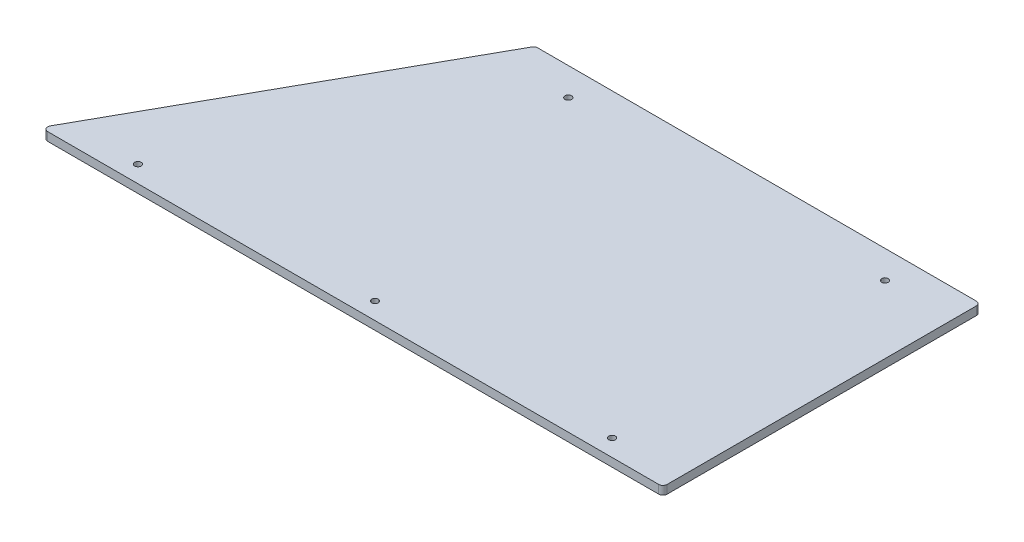
ISO-10303-21;
HEADER;
FILE_DESCRIPTION(('STEP AP214'),'2;1');
FILE_NAME('part.step','',(''),(''),'','','');
FILE_SCHEMA(('AUTOMOTIVE_DESIGN { 1 0 10303 214 1 1 1 1 }'));
ENDSEC;
DATA;
#1=APPLICATION_CONTEXT('core data for automotive mechanical design processes');
#2=APPLICATION_PROTOCOL_DEFINITION('international standard','automotive_design',2000,#1);
#3=PRODUCT_CONTEXT('',#1,'mechanical');
#4=PRODUCT('Part','Part','',(#3));
#5=PRODUCT_RELATED_PRODUCT_CATEGORY('part','',(#4));
#6=PRODUCT_DEFINITION_FORMATION('','',#4);
#7=PRODUCT_DEFINITION_CONTEXT('part definition',#1,'design');
#8=PRODUCT_DEFINITION('design','',#6,#7);
#9=PRODUCT_DEFINITION_SHAPE('','',#8);
#10=(LENGTH_UNIT() NAMED_UNIT(*) SI_UNIT(.MILLI.,.METRE.));
#11=(NAMED_UNIT(*) PLANE_ANGLE_UNIT() SI_UNIT($,.RADIAN.));
#12=(NAMED_UNIT(*) SI_UNIT($,.STERADIAN.) SOLID_ANGLE_UNIT());
#13=UNCERTAINTY_MEASURE_WITH_UNIT(LENGTH_MEASURE(1.E-05),#10,'distance_accuracy_value','');
#14=(GEOMETRIC_REPRESENTATION_CONTEXT(3) GLOBAL_UNCERTAINTY_ASSIGNED_CONTEXT((#13)) GLOBAL_UNIT_ASSIGNED_CONTEXT((#10,
#11,#12)) REPRESENTATION_CONTEXT('',''));
#15=CARTESIAN_POINT('',(0.,0.,0.));
#16=DIRECTION('',(0.,0.,1.));
#17=DIRECTION('',(1.,0.,0.));
#18=AXIS2_PLACEMENT_3D('',#15,#16,#17);
#19=CARTESIAN_POINT('',(0.,6.35,0.));
#20=DIRECTION('',(0.,1.,0.));
#21=DIRECTION('',(0.,0.,1.));
#22=AXIS2_PLACEMENT_3D('',#19,#20,#21);
#23=PLANE('',#22);
#24=CARTESIAN_POINT('',(60.325,6.35,-12.7));
#25=DIRECTION('',(0.,1.,0.));
#26=DIRECTION('',(0.,0.,1.));
#27=AXIS2_PLACEMENT_3D('',#24,#25,#26);
#28=CIRCLE('',#27,2.45745);
#29=CARTESIAN_POINT('',(60.325,6.35,-10.24255));
#30=VERTEX_POINT('',#29);
#31=EDGE_CURVE('E196',#30,#30,#28,.T.);
#32=ORIENTED_EDGE('',*,*,#31,.F.);
#33=EDGE_LOOP('',(#32));
#34=FACE_BOUND('',#33,.T.);
#35=CARTESIAN_POINT('',(415.925,6.35,-12.7));
#36=DIRECTION('',(0.,1.,0.));
#37=DIRECTION('',(0.,0.,1.));
#38=AXIS2_PLACEMENT_3D('',#35,#36,#37);
#39=CIRCLE('',#38,2.45744999999996);
#40=CARTESIAN_POINT('',(415.925,6.35,-10.24255));
#41=VERTEX_POINT('',#40);
#42=EDGE_CURVE('E185',#41,#41,#39,.T.);
#43=ORIENTED_EDGE('',*,*,#42,.F.);
#44=EDGE_LOOP('',(#43));
#45=FACE_BOUND('',#44,.T.);
#46=DIRECTION('',(-0.487097705254162,0.,0.873347482698685));
#47=VECTOR('',#46,1.);
#48=CARTESIAN_POINT('',(0.,6.35,0.));
#49=LINE('',#48,#47);
#50=CARTESIAN_POINT('',(131.902732744387,6.35,-236.496535214182));
#51=VERTEX_POINT('',#50);
#52=CARTESIAN_POINT('',(2.63337218422856,6.35,-4.72153521418196));
#53=VERTEX_POINT('',#52);
#54=EDGE_CURVE('E140',#51,#53,#49,.T.);
#55=ORIENTED_EDGE('',*,*,#54,.T.);
#56=CARTESIAN_POINT('',(5.40625044179688,6.35,-3.175));
#57=DIRECTION('',(0.,1.,0.));
#58=DIRECTION('',(0.,0.,1.));
#59=AXIS2_PLACEMENT_3D('',#56,#57,#58);
#60=CIRCLE('',#59,3.175);
#61=CARTESIAN_POINT('',(5.40625044179688,6.35,0.));
#62=VERTEX_POINT('',#61);
#63=EDGE_CURVE('E159',#53,#62,#60,.T.);
#64=ORIENTED_EDGE('',*,*,#63,.T.);
#65=DIRECTION('',(1.,0.,0.));
#66=VECTOR('',#65,1.);
#67=CARTESIAN_POINT('',(466.725,6.35,0.));
#68=LINE('',#67,#66);
#69=CARTESIAN_POINT('',(463.55,6.35,0.));
#70=VERTEX_POINT('',#69);
#71=EDGE_CURVE('E123',#62,#70,#68,.T.);
#72=ORIENTED_EDGE('',*,*,#71,.T.);
#73=CARTESIAN_POINT('',(463.55,6.35,-3.17500000000001));
#74=DIRECTION('',(0.,1.,0.));
#75=DIRECTION('',(0.,0.,1.));
#76=AXIS2_PLACEMENT_3D('',#73,#74,#75);
#77=CIRCLE('',#76,3.175);
#78=CARTESIAN_POINT('',(466.725,6.35,-3.17500000000001));
#79=VERTEX_POINT('',#78);
#80=EDGE_CURVE('E154',#70,#79,#77,.T.);
#81=ORIENTED_EDGE('',*,*,#80,.T.);
#82=DIRECTION('',(0.,0.,-1.));
#83=VECTOR('',#82,1.);
#84=CARTESIAN_POINT('',(466.725,6.35,-238.125));
#85=LINE('',#84,#83);
#86=CARTESIAN_POINT('',(466.725,6.35,-234.95));
#87=VERTEX_POINT('',#86);
#88=EDGE_CURVE('E170',#79,#87,#85,.T.);
#89=ORIENTED_EDGE('',*,*,#88,.T.);
#90=CARTESIAN_POINT('',(463.55,6.35,-234.95));
#91=DIRECTION('',(0.,1.,0.));
#92=DIRECTION('',(0.,0.,1.));
#93=AXIS2_PLACEMENT_3D('',#90,#91,#92);
#94=CIRCLE('',#93,3.175);
#95=CARTESIAN_POINT('',(463.55,6.35,-238.125));
#96=VERTEX_POINT('',#95);
#97=EDGE_CURVE('E59',#87,#96,#94,.T.);
#98=ORIENTED_EDGE('',*,*,#97,.T.);
#99=DIRECTION('',(-1.,0.,0.));
#100=VECTOR('',#99,1.);
#101=CARTESIAN_POINT('',(132.810986876875,6.35,-238.125));
#102=LINE('',#101,#100);
#103=CARTESIAN_POINT('',(134.675611001956,6.35,-238.125));
#104=VERTEX_POINT('',#103);
#105=EDGE_CURVE('E178',#96,#104,#102,.T.);
#106=ORIENTED_EDGE('',*,*,#105,.T.);
#107=CARTESIAN_POINT('',(134.675611001956,6.35,-234.95));
#108=DIRECTION('',(0.,1.,0.));
#109=DIRECTION('',(0.,0.,1.));
#110=AXIS2_PLACEMENT_3D('',#107,#108,#109);
#111=CIRCLE('',#110,3.175);
#112=EDGE_CURVE('E157',#104,#51,#111,.T.);
#113=ORIENTED_EDGE('',*,*,#112,.T.);
#114=EDGE_LOOP('',(#55,#64,#72,#81,#89,#98,#106,#113));
#115=FACE_BOUND('',#114,.T.);
#116=CARTESIAN_POINT('',(415.925,6.35,-217.297));
#117=DIRECTION('',(0.,1.,0.));
#118=DIRECTION('',(0.,0.,1.));
#119=AXIS2_PLACEMENT_3D('',#116,#117,#118);
#120=CIRCLE('',#119,2.45744999999996);
#121=CARTESIAN_POINT('',(415.925,6.35,-214.83955));
#122=VERTEX_POINT('',#121);
#123=EDGE_CURVE('E131',#122,#122,#120,.T.);
#124=ORIENTED_EDGE('',*,*,#123,.F.);
#125=EDGE_LOOP('',(#124));
#126=FACE_BOUND('',#125,.T.);
#127=CARTESIAN_POINT('',(238.125,6.35,-12.7));
#128=DIRECTION('',(0.,1.,0.));
#129=DIRECTION('',(0.,0.,1.));
#130=AXIS2_PLACEMENT_3D('',#127,#128,#129);
#131=CIRCLE('',#130,2.45745000000002);
#132=CARTESIAN_POINT('',(238.125,6.35,-10.24255));
#133=VERTEX_POINT('',#132);
#134=EDGE_CURVE('E190',#133,#133,#131,.T.);
#135=ORIENTED_EDGE('',*,*,#134,.F.);
#136=EDGE_LOOP('',(#135));
#137=FACE_BOUND('',#136,.T.);
#138=CARTESIAN_POINT('',(178.449400022,6.35,-217.297));
#139=DIRECTION('',(0.,1.,0.));
#140=DIRECTION('',(0.,0.,1.));
#141=AXIS2_PLACEMENT_3D('',#138,#139,#140);
#142=CIRCLE('',#141,2.45744999999992);
#143=CARTESIAN_POINT('',(178.449400022,6.35,-214.83955));
#144=VERTEX_POINT('',#143);
#145=EDGE_CURVE('E202',#144,#144,#142,.T.);
#146=ORIENTED_EDGE('',*,*,#145,.F.);
#147=EDGE_LOOP('',(#146));
#148=FACE_BOUND('',#147,.T.);
#149=ADVANCED_FACE('F37',(#34,#45,#115,#126,#137,#148),#23,.T.);
#150=CARTESIAN_POINT('',(0.,0.,0.));
#151=DIRECTION('',(0.,1.,0.));
#152=DIRECTION('',(0.,0.,1.));
#153=AXIS2_PLACEMENT_3D('',#150,#151,#152);
#154=PLANE('',#153);
#155=DIRECTION('',(1.,0.,0.));
#156=VECTOR('',#155,1.);
#157=CARTESIAN_POINT('',(466.725,0.,0.));
#158=LINE('',#157,#156);
#159=CARTESIAN_POINT('',(5.40625044179688,0.,0.));
#160=VERTEX_POINT('',#159);
#161=CARTESIAN_POINT('',(463.55,0.,0.));
#162=VERTEX_POINT('',#161);
#163=EDGE_CURVE('E120',#160,#162,#158,.T.);
#164=ORIENTED_EDGE('',*,*,#163,.F.);
#165=CARTESIAN_POINT('',(5.40625044179688,0.,-3.175));
#166=DIRECTION('',(0.,1.,0.));
#167=DIRECTION('',(0.,0.,1.));
#168=AXIS2_PLACEMENT_3D('',#165,#166,#167);
#169=CIRCLE('',#168,3.175);
#170=CARTESIAN_POINT('',(2.63337218422856,0.,-4.72153521418196));
#171=VERTEX_POINT('',#170);
#172=EDGE_CURVE('E103',#160,#171,#169,.F.);
#173=ORIENTED_EDGE('',*,*,#172,.T.);
#174=DIRECTION('',(-0.487097705254162,0.,0.873347482698685));
#175=VECTOR('',#174,1.);
#176=CARTESIAN_POINT('',(0.,0.,0.));
#177=LINE('',#176,#175);
#178=CARTESIAN_POINT('',(131.902732744387,0.,-236.496535214182));
#179=VERTEX_POINT('',#178);
#180=EDGE_CURVE('E144',#179,#171,#177,.T.);
#181=ORIENTED_EDGE('',*,*,#180,.F.);
#182=CARTESIAN_POINT('',(134.675611001956,0.,-234.95));
#183=DIRECTION('',(0.,1.,0.));
#184=DIRECTION('',(0.,0.,1.));
#185=AXIS2_PLACEMENT_3D('',#182,#183,#184);
#186=CIRCLE('',#185,3.175);
#187=CARTESIAN_POINT('',(134.675611001956,0.,-238.125));
#188=VERTEX_POINT('',#187);
#189=EDGE_CURVE('E114',#179,#188,#186,.F.);
#190=ORIENTED_EDGE('',*,*,#189,.T.);
#191=DIRECTION('',(-1.,0.,0.));
#192=VECTOR('',#191,1.);
#193=CARTESIAN_POINT('',(132.810986876875,0.,-238.125));
#194=LINE('',#193,#192);
#195=CARTESIAN_POINT('',(463.55,0.,-238.125));
#196=VERTEX_POINT('',#195);
#197=EDGE_CURVE('E134',#196,#188,#194,.T.);
#198=ORIENTED_EDGE('',*,*,#197,.F.);
#199=CARTESIAN_POINT('',(463.55,0.,-234.95));
#200=DIRECTION('',(0.,1.,0.));
#201=DIRECTION('',(0.,0.,1.));
#202=AXIS2_PLACEMENT_3D('',#199,#200,#201);
#203=CIRCLE('',#202,3.175);
#204=CARTESIAN_POINT('',(466.725,0.,-234.95));
#205=VERTEX_POINT('',#204);
#206=EDGE_CURVE('E148',#196,#205,#203,.F.);
#207=ORIENTED_EDGE('',*,*,#206,.T.);
#208=DIRECTION('',(0.,0.,-1.));
#209=VECTOR('',#208,1.);
#210=CARTESIAN_POINT('',(466.725,0.,-238.125));
#211=LINE('',#210,#209);
#212=CARTESIAN_POINT('',(466.725,0.,-3.17500000000001));
#213=VERTEX_POINT('',#212);
#214=EDGE_CURVE('E130',#213,#205,#211,.T.);
#215=ORIENTED_EDGE('',*,*,#214,.F.);
#216=CARTESIAN_POINT('',(463.55,0.,-3.17500000000001));
#217=DIRECTION('',(0.,1.,0.));
#218=DIRECTION('',(0.,0.,1.));
#219=AXIS2_PLACEMENT_3D('',#216,#217,#218);
#220=CIRCLE('',#219,3.175);
#221=EDGE_CURVE('E124',#213,#162,#220,.F.);
#222=ORIENTED_EDGE('',*,*,#221,.T.);
#223=EDGE_LOOP('',(#164,#173,#181,#190,#198,#207,#215,#222));
#224=FACE_BOUND('',#223,.T.);
#225=CARTESIAN_POINT('',(415.925,0.,-217.297));
#226=DIRECTION('',(0.,1.,0.));
#227=DIRECTION('',(0.,0.,1.));
#228=AXIS2_PLACEMENT_3D('',#225,#226,#227);
#229=CIRCLE('',#228,2.45744999999996);
#230=CARTESIAN_POINT('',(415.925,0.,-214.83955));
#231=VERTEX_POINT('',#230);
#232=EDGE_CURVE('E137',#231,#231,#229,.T.);
#233=ORIENTED_EDGE('',*,*,#232,.T.);
#234=EDGE_LOOP('',(#233));
#235=FACE_BOUND('',#234,.T.);
#236=CARTESIAN_POINT('',(415.925,0.,-12.7));
#237=DIRECTION('',(0.,1.,0.));
#238=DIRECTION('',(0.,0.,1.));
#239=AXIS2_PLACEMENT_3D('',#236,#237,#238);
#240=CIRCLE('',#239,2.45744999999996);
#241=CARTESIAN_POINT('',(415.925,0.,-10.24255));
#242=VERTEX_POINT('',#241);
#243=EDGE_CURVE('E187',#242,#242,#240,.T.);
#244=ORIENTED_EDGE('',*,*,#243,.T.);
#245=EDGE_LOOP('',(#244));
#246=FACE_BOUND('',#245,.T.);
#247=CARTESIAN_POINT('',(238.125,0.,-12.7));
#248=DIRECTION('',(0.,1.,0.));
#249=DIRECTION('',(0.,0.,1.));
#250=AXIS2_PLACEMENT_3D('',#247,#248,#249);
#251=CIRCLE('',#250,2.45745000000002);
#252=CARTESIAN_POINT('',(238.125,0.,-10.24255));
#253=VERTEX_POINT('',#252);
#254=EDGE_CURVE('E193',#253,#253,#251,.T.);
#255=ORIENTED_EDGE('',*,*,#254,.T.);
#256=EDGE_LOOP('',(#255));
#257=FACE_BOUND('',#256,.T.);
#258=CARTESIAN_POINT('',(60.325,0.,-12.7));
#259=DIRECTION('',(0.,1.,0.));
#260=DIRECTION('',(0.,0.,1.));
#261=AXIS2_PLACEMENT_3D('',#258,#259,#260);
#262=CIRCLE('',#261,2.45745);
#263=CARTESIAN_POINT('',(60.325,0.,-10.24255));
#264=VERTEX_POINT('',#263);
#265=EDGE_CURVE('E199',#264,#264,#262,.T.);
#266=ORIENTED_EDGE('',*,*,#265,.T.);
#267=EDGE_LOOP('',(#266));
#268=FACE_BOUND('',#267,.T.);
#269=CARTESIAN_POINT('',(178.449400022,0.,-217.297));
#270=DIRECTION('',(0.,1.,0.));
#271=DIRECTION('',(0.,0.,1.));
#272=AXIS2_PLACEMENT_3D('',#269,#270,#271);
#273=CIRCLE('',#272,2.45744999999992);
#274=CARTESIAN_POINT('',(178.449400022,0.,-214.83955));
#275=VERTEX_POINT('',#274);
#276=EDGE_CURVE('E205',#275,#275,#273,.T.);
#277=ORIENTED_EDGE('',*,*,#276,.T.);
#278=EDGE_LOOP('',(#277));
#279=FACE_BOUND('',#278,.T.);
#280=ADVANCED_FACE('F127',(#224,#235,#246,#257,#268,#279),#154,.F.);
#281=CARTESIAN_POINT('',(466.725,6.35,0.));
#282=DIRECTION('',(0.,0.,-1.));
#283=DIRECTION('',(-1.,0.,0.));
#284=AXIS2_PLACEMENT_3D('',#281,#282,#283);
#285=PLANE('',#284);
#286=ORIENTED_EDGE('',*,*,#71,.F.);
#287=DIRECTION('',(0.,-1.,0.));
#288=VECTOR('',#287,1.);
#289=CARTESIAN_POINT('',(5.40625044179688,6.35,0.));
#290=LINE('',#289,#288);
#291=EDGE_CURVE('E107',#62,#160,#290,.T.);
#292=ORIENTED_EDGE('',*,*,#291,.T.);
#293=ORIENTED_EDGE('',*,*,#163,.T.);
#294=DIRECTION('',(0.,-1.,0.));
#295=VECTOR('',#294,1.);
#296=CARTESIAN_POINT('',(463.55,6.35,0.));
#297=LINE('',#296,#295);
#298=EDGE_CURVE('E125',#162,#70,#297,.F.);
#299=ORIENTED_EDGE('',*,*,#298,.T.);
#300=EDGE_LOOP('',(#286,#292,#293,#299));
#301=FACE_BOUND('',#300,.T.);
#302=ADVANCED_FACE('F119',(#301),#285,.F.);
#303=CARTESIAN_POINT('',(466.725,6.35,-238.125));
#304=DIRECTION('',(-1.,0.,0.));
#305=DIRECTION('',(0.,0.,1.));
#306=AXIS2_PLACEMENT_3D('',#303,#304,#305);
#307=PLANE('',#306);
#308=ORIENTED_EDGE('',*,*,#214,.T.);
#309=DIRECTION('',(0.,-1.,0.));
#310=VECTOR('',#309,1.);
#311=CARTESIAN_POINT('',(466.725,6.35,-234.95));
#312=LINE('',#311,#310);
#313=EDGE_CURVE('E11',#205,#87,#312,.F.);
#314=ORIENTED_EDGE('',*,*,#313,.T.);
#315=ORIENTED_EDGE('',*,*,#88,.F.);
#316=DIRECTION('',(0.,-1.,0.));
#317=VECTOR('',#316,1.);
#318=CARTESIAN_POINT('',(466.725,6.35,-3.17500000000001));
#319=LINE('',#318,#317);
#320=EDGE_CURVE('E45',#79,#213,#319,.T.);
#321=ORIENTED_EDGE('',*,*,#320,.T.);
#322=EDGE_LOOP('',(#308,#314,#315,#321));
#323=FACE_BOUND('',#322,.T.);
#324=ADVANCED_FACE('F168',(#323),#307,.F.);
#325=CARTESIAN_POINT('',(132.810986876875,6.35,-238.125));
#326=DIRECTION('',(0.,0.,1.));
#327=DIRECTION('',(1.,0.,0.));
#328=AXIS2_PLACEMENT_3D('',#325,#326,#327);
#329=PLANE('',#328);
#330=ORIENTED_EDGE('',*,*,#197,.T.);
#331=DIRECTION('',(0.,-1.,0.));
#332=VECTOR('',#331,1.);
#333=CARTESIAN_POINT('',(134.675611001956,6.35,-238.125));
#334=LINE('',#333,#332);
#335=EDGE_CURVE('E52',#188,#104,#334,.F.);
#336=ORIENTED_EDGE('',*,*,#335,.T.);
#337=ORIENTED_EDGE('',*,*,#105,.F.);
#338=DIRECTION('',(0.,-1.,0.));
#339=VECTOR('',#338,1.);
#340=CARTESIAN_POINT('',(463.55,6.35,-238.125));
#341=LINE('',#340,#339);
#342=EDGE_CURVE('E161',#96,#196,#341,.T.);
#343=ORIENTED_EDGE('',*,*,#342,.T.);
#344=EDGE_LOOP('',(#330,#336,#337,#343));
#345=FACE_BOUND('',#344,.T.);
#346=ADVANCED_FACE('F177',(#345),#329,.F.);
#347=CARTESIAN_POINT('',(0.,6.35,0.));
#348=DIRECTION('',(0.873347482698685,0.,0.487097705254161));
#349=DIRECTION('',(0.487097705254162,0.,-0.873347482698685));
#350=AXIS2_PLACEMENT_3D('',#347,#348,#349);
#351=PLANE('',#350);
#352=ORIENTED_EDGE('',*,*,#180,.T.);
#353=DIRECTION('',(0.,-1.,0.));
#354=VECTOR('',#353,1.);
#355=CARTESIAN_POINT('',(2.63337218422856,6.35,-4.72153521418196));
#356=LINE('',#355,#354);
#357=EDGE_CURVE('E108',#171,#53,#356,.F.);
#358=ORIENTED_EDGE('',*,*,#357,.T.);
#359=ORIENTED_EDGE('',*,*,#54,.F.);
#360=DIRECTION('',(0.,-1.,0.));
#361=VECTOR('',#360,1.);
#362=CARTESIAN_POINT('',(131.902732744387,6.35,-236.496535214182));
#363=LINE('',#362,#361);
#364=EDGE_CURVE('E113',#51,#179,#363,.T.);
#365=ORIENTED_EDGE('',*,*,#364,.T.);
#366=EDGE_LOOP('',(#352,#358,#359,#365));
#367=FACE_BOUND('',#366,.T.);
#368=ADVANCED_FACE('F228',(#367),#351,.F.);
#369=CARTESIAN_POINT('',(415.925,6.35,-217.297));
#370=DIRECTION('',(0.,-1.,0.));
#371=DIRECTION('',(0.,0.,-1.));
#372=AXIS2_PLACEMENT_3D('',#369,#370,#371);
#373=CYLINDRICAL_SURFACE('',#372,2.45744999999996);
#374=ORIENTED_EDGE('',*,*,#123,.T.);
#375=EDGE_LOOP('',(#374));
#376=FACE_BOUND('',#375,.T.);
#377=ORIENTED_EDGE('',*,*,#232,.F.);
#378=EDGE_LOOP('',(#377));
#379=FACE_BOUND('',#378,.T.);
#380=ADVANCED_FACE('F225',(#376,#379),#373,.F.);
#381=CARTESIAN_POINT('',(415.925,6.35,-12.7));
#382=DIRECTION('',(0.,-1.,0.));
#383=DIRECTION('',(0.,0.,-1.));
#384=AXIS2_PLACEMENT_3D('',#381,#382,#383);
#385=CYLINDRICAL_SURFACE('',#384,2.45744999999996);
#386=ORIENTED_EDGE('',*,*,#42,.T.);
#387=EDGE_LOOP('',(#386));
#388=FACE_BOUND('',#387,.T.);
#389=ORIENTED_EDGE('',*,*,#243,.F.);
#390=EDGE_LOOP('',(#389));
#391=FACE_BOUND('',#390,.T.);
#392=ADVANCED_FACE('F260',(#388,#391),#385,.F.);
#393=CARTESIAN_POINT('',(238.125,6.35,-12.7));
#394=DIRECTION('',(0.,-1.,0.));
#395=DIRECTION('',(0.,0.,-1.));
#396=AXIS2_PLACEMENT_3D('',#393,#394,#395);
#397=CYLINDRICAL_SURFACE('',#396,2.45745000000002);
#398=ORIENTED_EDGE('',*,*,#134,.T.);
#399=EDGE_LOOP('',(#398));
#400=FACE_BOUND('',#399,.T.);
#401=ORIENTED_EDGE('',*,*,#254,.F.);
#402=EDGE_LOOP('',(#401));
#403=FACE_BOUND('',#402,.T.);
#404=ADVANCED_FACE('F256',(#400,#403),#397,.F.);
#405=CARTESIAN_POINT('',(60.325,6.35,-12.7));
#406=DIRECTION('',(0.,-1.,0.));
#407=DIRECTION('',(0.,0.,-1.));
#408=AXIS2_PLACEMENT_3D('',#405,#406,#407);
#409=CYLINDRICAL_SURFACE('',#408,2.45745);
#410=ORIENTED_EDGE('',*,*,#31,.T.);
#411=EDGE_LOOP('',(#410));
#412=FACE_BOUND('',#411,.T.);
#413=ORIENTED_EDGE('',*,*,#265,.F.);
#414=EDGE_LOOP('',(#413));
#415=FACE_BOUND('',#414,.T.);
#416=ADVANCED_FACE('F259',(#412,#415),#409,.F.);
#417=CARTESIAN_POINT('',(178.449400022,6.35,-217.297));
#418=DIRECTION('',(0.,-1.,0.));
#419=DIRECTION('',(0.,0.,-1.));
#420=AXIS2_PLACEMENT_3D('',#417,#418,#419);
#421=CYLINDRICAL_SURFACE('',#420,2.45744999999992);
#422=ORIENTED_EDGE('',*,*,#145,.T.);
#423=EDGE_LOOP('',(#422));
#424=FACE_BOUND('',#423,.T.);
#425=ORIENTED_EDGE('',*,*,#276,.F.);
#426=EDGE_LOOP('',(#425));
#427=FACE_BOUND('',#426,.T.);
#428=ADVANCED_FACE('F211',(#424,#427),#421,.F.);
#429=CARTESIAN_POINT('',(5.40625044179688,6.35,-3.175));
#430=DIRECTION('',(0.,-1.,0.));
#431=DIRECTION('',(0.,0.,-1.));
#432=AXIS2_PLACEMENT_3D('',#429,#430,#431);
#433=CYLINDRICAL_SURFACE('',#432,3.175);
#434=ORIENTED_EDGE('',*,*,#63,.F.);
#435=ORIENTED_EDGE('',*,*,#357,.F.);
#436=ORIENTED_EDGE('',*,*,#172,.F.);
#437=ORIENTED_EDGE('',*,*,#291,.F.);
#438=EDGE_LOOP('',(#434,#435,#436,#437));
#439=FACE_BOUND('',#438,.T.);
#440=ADVANCED_FACE('F106',(#439),#433,.T.);
#441=CARTESIAN_POINT('',(134.675611001956,6.35,-234.95));
#442=DIRECTION('',(0.,-1.,0.));
#443=DIRECTION('',(0.,0.,-1.));
#444=AXIS2_PLACEMENT_3D('',#441,#442,#443);
#445=CYLINDRICAL_SURFACE('',#444,3.175);
#446=ORIENTED_EDGE('',*,*,#112,.F.);
#447=ORIENTED_EDGE('',*,*,#335,.F.);
#448=ORIENTED_EDGE('',*,*,#189,.F.);
#449=ORIENTED_EDGE('',*,*,#364,.F.);
#450=EDGE_LOOP('',(#446,#447,#448,#449));
#451=FACE_BOUND('',#450,.T.);
#452=ADVANCED_FACE('F240',(#451),#445,.T.);
#453=CARTESIAN_POINT('',(463.55,6.35,-234.95));
#454=DIRECTION('',(0.,-1.,0.));
#455=DIRECTION('',(0.,0.,-1.));
#456=AXIS2_PLACEMENT_3D('',#453,#454,#455);
#457=CYLINDRICAL_SURFACE('',#456,3.175);
#458=ORIENTED_EDGE('',*,*,#97,.F.);
#459=ORIENTED_EDGE('',*,*,#313,.F.);
#460=ORIENTED_EDGE('',*,*,#206,.F.);
#461=ORIENTED_EDGE('',*,*,#342,.F.);
#462=EDGE_LOOP('',(#458,#459,#460,#461));
#463=FACE_BOUND('',#462,.T.);
#464=ADVANCED_FACE('F176',(#463),#457,.T.);
#465=CARTESIAN_POINT('',(463.55,6.35,-3.17500000000001));
#466=DIRECTION('',(0.,-1.,0.));
#467=DIRECTION('',(0.,0.,-1.));
#468=AXIS2_PLACEMENT_3D('',#465,#466,#467);
#469=CYLINDRICAL_SURFACE('',#468,3.175);
#470=ORIENTED_EDGE('',*,*,#80,.F.);
#471=ORIENTED_EDGE('',*,*,#298,.F.);
#472=ORIENTED_EDGE('',*,*,#221,.F.);
#473=ORIENTED_EDGE('',*,*,#320,.F.);
#474=EDGE_LOOP('',(#470,#471,#472,#473));
#475=FACE_BOUND('',#474,.T.);
#476=ADVANCED_FACE('F39',(#475),#469,.T.);
#477=CLOSED_SHELL('',(#149,#280,#302,#324,#346,#368,#380,#392,#404,#416,#428,#440,#452,#464,#476));
#478=MANIFOLD_SOLID_BREP('B2',#477);
#479=ADVANCED_BREP_SHAPE_REPRESENTATION('',(#18,#478),#14);
#480=SHAPE_DEFINITION_REPRESENTATION(#9,#479);
ENDSEC;
END-ISO-10303-21;
